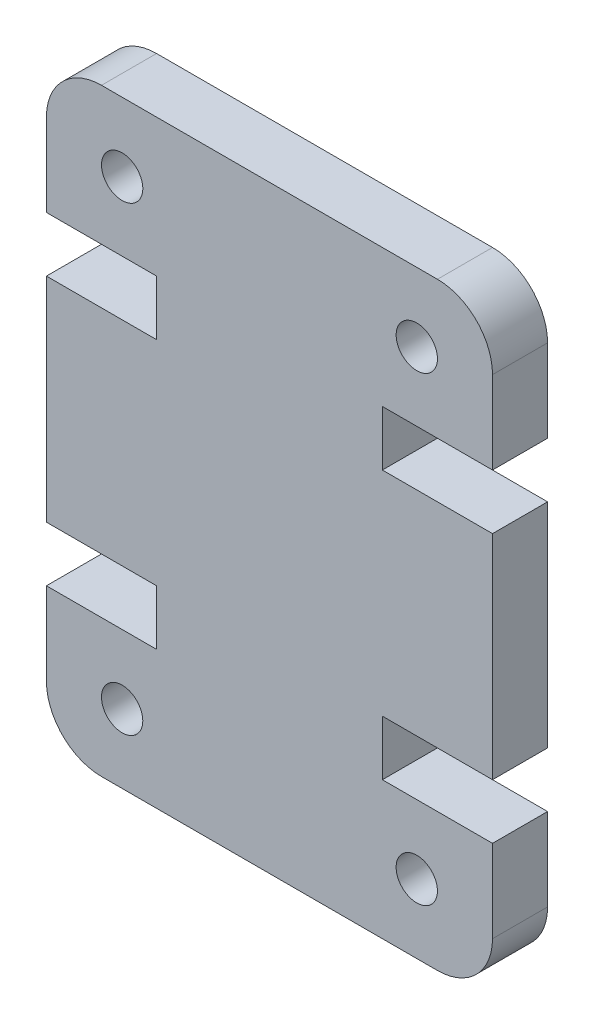
ISO-10303-21;
HEADER;
FILE_DESCRIPTION(('STEP AP214'),'2;1');
FILE_NAME('part.step','',(''),(''),'','','');
FILE_SCHEMA(('AUTOMOTIVE_DESIGN { 1 0 10303 214 1 1 1 1 }'));
ENDSEC;
DATA;
#1=APPLICATION_CONTEXT('core data for automotive mechanical design processes');
#2=APPLICATION_PROTOCOL_DEFINITION('international standard','automotive_design',2000,#1);
#3=PRODUCT_CONTEXT('',#1,'mechanical');
#4=PRODUCT('Part','Part','',(#3));
#5=PRODUCT_RELATED_PRODUCT_CATEGORY('part','',(#4));
#6=PRODUCT_DEFINITION_FORMATION('','',#4);
#7=PRODUCT_DEFINITION_CONTEXT('part definition',#1,'design');
#8=PRODUCT_DEFINITION('design','',#6,#7);
#9=PRODUCT_DEFINITION_SHAPE('','',#8);
#10=(LENGTH_UNIT() NAMED_UNIT(*) SI_UNIT(.MILLI.,.METRE.));
#11=(NAMED_UNIT(*) PLANE_ANGLE_UNIT() SI_UNIT($,.RADIAN.));
#12=(NAMED_UNIT(*) SI_UNIT($,.STERADIAN.) SOLID_ANGLE_UNIT());
#13=UNCERTAINTY_MEASURE_WITH_UNIT(LENGTH_MEASURE(1.E-05),#10,'distance_accuracy_value','');
#14=(GEOMETRIC_REPRESENTATION_CONTEXT(3) GLOBAL_UNCERTAINTY_ASSIGNED_CONTEXT((#13)) GLOBAL_UNIT_ASSIGNED_CONTEXT((#10,
#11,#12)) REPRESENTATION_CONTEXT('',''));
#15=CARTESIAN_POINT('',(0.,0.,0.));
#16=DIRECTION('',(0.,0.,1.));
#17=DIRECTION('',(1.,0.,0.));
#18=AXIS2_PLACEMENT_3D('',#15,#16,#17);
#19=CARTESIAN_POINT('',(14.2,2.,2.));
#20=DIRECTION('',(0.,0.,-1.));
#21=DIRECTION('',(-1.,0.,0.));
#22=AXIS2_PLACEMENT_3D('',#19,#20,#21);
#23=PLANE('',#22);
#24=CARTESIAN_POINT('',(2.75000000000004,19.2399999999998,2.));
#25=DIRECTION('',(0.,0.,1.));
#26=DIRECTION('',(-1.,0.,0.));
#27=AXIS2_PLACEMENT_3D('',#24,#25,#26);
#28=CIRCLE('',#27,0.75);
#29=CARTESIAN_POINT('',(2.00000000000004,19.2399999999998,2.));
#30=VERTEX_POINT('',#29);
#31=EDGE_CURVE('E448',#30,#30,#28,.T.);
#32=ORIENTED_EDGE('',*,*,#31,.F.);
#33=EDGE_LOOP('',(#32));
#34=FACE_BOUND('',#33,.T.);
#35=CARTESIAN_POINT('',(13.45,2.50000000000017,2.));
#36=DIRECTION('',(0.,0.,1.));
#37=DIRECTION('',(-1.,0.,0.));
#38=AXIS2_PLACEMENT_3D('',#35,#36,#37);
#39=CIRCLE('',#38,0.750000000000008);
#40=CARTESIAN_POINT('',(12.6999999999999,2.50000000000017,2.));
#41=VERTEX_POINT('',#40);
#42=EDGE_CURVE('E230',#41,#41,#39,.T.);
#43=ORIENTED_EDGE('',*,*,#42,.F.);
#44=EDGE_LOOP('',(#43));
#45=FACE_BOUND('',#44,.T.);
#46=CARTESIAN_POINT('',(14.2,2.,2.));
#47=DIRECTION('',(0.,0.,1.));
#48=DIRECTION('',(-1.,0.,0.));
#49=AXIS2_PLACEMENT_3D('',#46,#47,#48);
#50=CIRCLE('',#49,2.);
#51=CARTESIAN_POINT('',(14.2,0.,2.));
#52=VERTEX_POINT('',#51);
#53=CARTESIAN_POINT('',(16.2,2.,2.));
#54=VERTEX_POINT('',#53);
#55=EDGE_CURVE('E273',#52,#54,#50,.T.);
#56=ORIENTED_EDGE('',*,*,#55,.T.);
#57=DIRECTION('',(0.,1.,0.));
#58=VECTOR('',#57,1.);
#59=CARTESIAN_POINT('',(16.2,2.,2.));
#60=LINE('',#59,#58);
#61=CARTESIAN_POINT('',(16.2,4.99999999999945,2.));
#62=VERTEX_POINT('',#61);
#63=EDGE_CURVE('E141',#54,#62,#60,.T.);
#64=ORIENTED_EDGE('',*,*,#63,.T.);
#65=DIRECTION('',(-1.,0.,0.));
#66=VECTOR('',#65,1.);
#67=CARTESIAN_POINT('',(12.2,4.99999999999945,2.));
#68=LINE('',#67,#66);
#69=CARTESIAN_POINT('',(12.2,4.99999999999945,2.));
#70=VERTEX_POINT('',#69);
#71=EDGE_CURVE('E336',#62,#70,#68,.T.);
#72=ORIENTED_EDGE('',*,*,#71,.T.);
#73=DIRECTION('',(0.,1.,0.));
#74=VECTOR('',#73,1.);
#75=CARTESIAN_POINT('',(12.2,6.99999999999945,2.));
#76=LINE('',#75,#74);
#77=CARTESIAN_POINT('',(12.2,6.99999999999945,2.));
#78=VERTEX_POINT('',#77);
#79=EDGE_CURVE('E355',#70,#78,#76,.T.);
#80=ORIENTED_EDGE('',*,*,#79,.T.);
#81=DIRECTION('',(1.,0.,0.));
#82=VECTOR('',#81,1.);
#83=CARTESIAN_POINT('',(16.2,6.99999999999945,2.));
#84=LINE('',#83,#82);
#85=CARTESIAN_POINT('',(16.2,6.99999999999945,2.));
#86=VERTEX_POINT('',#85);
#87=EDGE_CURVE('E352',#78,#86,#84,.T.);
#88=ORIENTED_EDGE('',*,*,#87,.T.);
#89=DIRECTION('',(0.,1.,0.));
#90=VECTOR('',#89,1.);
#91=CARTESIAN_POINT('',(16.2,14.7400000000005,2.));
#92=LINE('',#91,#90);
#93=CARTESIAN_POINT('',(16.2,14.7400000000005,2.));
#94=VERTEX_POINT('',#93);
#95=EDGE_CURVE('E354',#86,#94,#92,.T.);
#96=ORIENTED_EDGE('',*,*,#95,.T.);
#97=DIRECTION('',(-1.,0.,0.));
#98=VECTOR('',#97,1.);
#99=CARTESIAN_POINT('',(16.2,14.7400000000005,2.));
#100=LINE('',#99,#98);
#101=CARTESIAN_POINT('',(12.2,14.7400000000005,2.));
#102=VERTEX_POINT('',#101);
#103=EDGE_CURVE('E357',#94,#102,#100,.T.);
#104=ORIENTED_EDGE('',*,*,#103,.T.);
#105=DIRECTION('',(0.,1.,0.));
#106=VECTOR('',#105,1.);
#107=CARTESIAN_POINT('',(12.2,14.7400000000005,2.));
#108=LINE('',#107,#106);
#109=CARTESIAN_POINT('',(12.2,16.7400000000005,2.));
#110=VERTEX_POINT('',#109);
#111=EDGE_CURVE('E363',#102,#110,#108,.T.);
#112=ORIENTED_EDGE('',*,*,#111,.T.);
#113=DIRECTION('',(1.,0.,0.));
#114=VECTOR('',#113,1.);
#115=CARTESIAN_POINT('',(12.2,16.7400000000005,2.));
#116=LINE('',#115,#114);
#117=CARTESIAN_POINT('',(16.2,16.7400000000005,2.));
#118=VERTEX_POINT('',#117);
#119=EDGE_CURVE('E365',#110,#118,#116,.T.);
#120=ORIENTED_EDGE('',*,*,#119,.T.);
#121=DIRECTION('',(0.,1.,0.));
#122=VECTOR('',#121,1.);
#123=CARTESIAN_POINT('',(16.2,19.74,2.));
#124=LINE('',#123,#122);
#125=CARTESIAN_POINT('',(16.2,19.74,2.));
#126=VERTEX_POINT('',#125);
#127=EDGE_CURVE('E367',#118,#126,#124,.T.);
#128=ORIENTED_EDGE('',*,*,#127,.T.);
#129=CARTESIAN_POINT('',(14.2,19.74,2.));
#130=DIRECTION('',(0.,0.,1.));
#131=DIRECTION('',(1.,0.,0.));
#132=AXIS2_PLACEMENT_3D('',#129,#130,#131);
#133=CIRCLE('',#132,2.);
#134=CARTESIAN_POINT('',(14.2,21.74,2.));
#135=VERTEX_POINT('',#134);
#136=EDGE_CURVE('E369',#126,#135,#133,.T.);
#137=ORIENTED_EDGE('',*,*,#136,.T.);
#138=DIRECTION('',(-1.,0.,0.));
#139=VECTOR('',#138,1.);
#140=CARTESIAN_POINT('',(1.99999999999999,21.74,2.));
#141=LINE('',#140,#139);
#142=CARTESIAN_POINT('',(1.99999999999999,21.74,2.));
#143=VERTEX_POINT('',#142);
#144=EDGE_CURVE('E371',#135,#143,#141,.T.);
#145=ORIENTED_EDGE('',*,*,#144,.T.);
#146=CARTESIAN_POINT('',(2.,19.74,2.));
#147=DIRECTION('',(0.,0.,1.));
#148=DIRECTION('',(-1.,0.,0.));
#149=AXIS2_PLACEMENT_3D('',#146,#147,#148);
#150=CIRCLE('',#149,2.);
#151=CARTESIAN_POINT('',(0.,19.74,2.));
#152=VERTEX_POINT('',#151);
#153=EDGE_CURVE('E373',#143,#152,#150,.T.);
#154=ORIENTED_EDGE('',*,*,#153,.T.);
#155=DIRECTION('',(0.,-1.,0.));
#156=VECTOR('',#155,1.);
#157=CARTESIAN_POINT('',(0.,19.74,2.));
#158=LINE('',#157,#156);
#159=CARTESIAN_POINT('',(0.,16.7400000000005,2.));
#160=VERTEX_POINT('',#159);
#161=EDGE_CURVE('E375',#152,#160,#158,.T.);
#162=ORIENTED_EDGE('',*,*,#161,.T.);
#163=DIRECTION('',(1.,0.,0.));
#164=VECTOR('',#163,1.);
#165=CARTESIAN_POINT('',(4.,16.7400000000005,2.));
#166=LINE('',#165,#164);
#167=CARTESIAN_POINT('',(4.,16.7400000000005,2.));
#168=VERTEX_POINT('',#167);
#169=EDGE_CURVE('E377',#160,#168,#166,.T.);
#170=ORIENTED_EDGE('',*,*,#169,.T.);
#171=DIRECTION('',(0.,-1.,0.));
#172=VECTOR('',#171,1.);
#173=CARTESIAN_POINT('',(4.,14.7400000000005,2.));
#174=LINE('',#173,#172);
#175=CARTESIAN_POINT('',(4.,14.7400000000005,2.));
#176=VERTEX_POINT('',#175);
#177=EDGE_CURVE('E379',#168,#176,#174,.T.);
#178=ORIENTED_EDGE('',*,*,#177,.T.);
#179=DIRECTION('',(-1.,0.,0.));
#180=VECTOR('',#179,1.);
#181=CARTESIAN_POINT('',(0.,14.7400000000005,2.));
#182=LINE('',#181,#180);
#183=CARTESIAN_POINT('',(0.,14.7400000000005,2.));
#184=VERTEX_POINT('',#183);
#185=EDGE_CURVE('E381',#176,#184,#182,.T.);
#186=ORIENTED_EDGE('',*,*,#185,.T.);
#187=DIRECTION('',(0.,-1.,0.));
#188=VECTOR('',#187,1.);
#189=CARTESIAN_POINT('',(0.,14.7400000000005,2.));
#190=LINE('',#189,#188);
#191=CARTESIAN_POINT('',(0.,6.99999999999946,2.));
#192=VERTEX_POINT('',#191);
#193=EDGE_CURVE('E383',#184,#192,#190,.T.);
#194=ORIENTED_EDGE('',*,*,#193,.T.);
#195=DIRECTION('',(1.,0.,0.));
#196=VECTOR('',#195,1.);
#197=CARTESIAN_POINT('',(0.,6.99999999999946,2.));
#198=LINE('',#197,#196);
#199=CARTESIAN_POINT('',(4.00000000000002,6.99999999999946,2.));
#200=VERTEX_POINT('',#199);
#201=EDGE_CURVE('E385',#192,#200,#198,.T.);
#202=ORIENTED_EDGE('',*,*,#201,.T.);
#203=DIRECTION('',(0.,-1.,0.));
#204=VECTOR('',#203,1.);
#205=CARTESIAN_POINT('',(4.00000000000002,6.99999999999946,2.));
#206=LINE('',#205,#204);
#207=CARTESIAN_POINT('',(4.,4.99999999999945,2.));
#208=VERTEX_POINT('',#207);
#209=EDGE_CURVE('E387',#200,#208,#206,.T.);
#210=ORIENTED_EDGE('',*,*,#209,.T.);
#211=DIRECTION('',(-1.,0.,0.));
#212=VECTOR('',#211,1.);
#213=CARTESIAN_POINT('',(4.,4.99999999999945,2.));
#214=LINE('',#213,#212);
#215=CARTESIAN_POINT('',(0.,4.99999999999945,2.));
#216=VERTEX_POINT('',#215);
#217=EDGE_CURVE('E208',#208,#216,#214,.T.);
#218=ORIENTED_EDGE('',*,*,#217,.T.);
#219=DIRECTION('',(0.,-1.,0.));
#220=VECTOR('',#219,1.);
#221=CARTESIAN_POINT('',(0.,2.,2.));
#222=LINE('',#221,#220);
#223=CARTESIAN_POINT('',(0.,2.,2.));
#224=VERTEX_POINT('',#223);
#225=EDGE_CURVE('E202',#216,#224,#222,.T.);
#226=ORIENTED_EDGE('',*,*,#225,.T.);
#227=CARTESIAN_POINT('',(2.00000000000002,2.,2.));
#228=DIRECTION('',(0.,0.,1.));
#229=DIRECTION('',(1.,0.,0.));
#230=AXIS2_PLACEMENT_3D('',#227,#228,#229);
#231=CIRCLE('',#230,2.00000000000001);
#232=CARTESIAN_POINT('',(2.00000000000002,0.,2.));
#233=VERTEX_POINT('',#232);
#234=EDGE_CURVE('E206',#224,#233,#231,.T.);
#235=ORIENTED_EDGE('',*,*,#234,.T.);
#236=DIRECTION('',(1.,0.,0.));
#237=VECTOR('',#236,1.);
#238=CARTESIAN_POINT('',(2.00000000000002,0.,2.));
#239=LINE('',#238,#237);
#240=EDGE_CURVE('E50',#233,#52,#239,.T.);
#241=ORIENTED_EDGE('',*,*,#240,.T.);
#242=EDGE_LOOP('',(#56,#64,#72,#80,#88,#96,#104,#112,#120,#128,#137,#145,#154,#162,#170,#178,
#186,#194,#202,#210,#218,#226,#235,#241));
#243=FACE_BOUND('',#242,.T.);
#244=CARTESIAN_POINT('',(2.75000000000004,2.50000000000017,2.));
#245=DIRECTION('',(0.,0.,1.));
#246=DIRECTION('',(1.,0.,0.));
#247=AXIS2_PLACEMENT_3D('',#244,#245,#246);
#248=CIRCLE('',#247,0.75);
#249=CARTESIAN_POINT('',(3.50000000000004,2.50000000000017,2.));
#250=VERTEX_POINT('',#249);
#251=EDGE_CURVE('E454',#250,#250,#248,.T.);
#252=ORIENTED_EDGE('',*,*,#251,.F.);
#253=EDGE_LOOP('',(#252));
#254=FACE_BOUND('',#253,.T.);
#255=CARTESIAN_POINT('',(13.45,19.2399999999998,2.));
#256=DIRECTION('',(0.,0.,1.));
#257=DIRECTION('',(1.,0.,0.));
#258=AXIS2_PLACEMENT_3D('',#255,#256,#257);
#259=CIRCLE('',#258,0.750000000000007);
#260=CARTESIAN_POINT('',(14.2,19.2399999999998,2.));
#261=VERTEX_POINT('',#260);
#262=EDGE_CURVE('E439',#261,#261,#259,.T.);
#263=ORIENTED_EDGE('',*,*,#262,.F.);
#264=EDGE_LOOP('',(#263));
#265=FACE_BOUND('',#264,.T.);
#266=ADVANCED_FACE('F33',(#34,#45,#243,#254,#265),#23,.F.);
#267=CARTESIAN_POINT('',(14.2,2.,0.));
#268=DIRECTION('',(0.,0.,-1.));
#269=DIRECTION('',(-1.,0.,0.));
#270=AXIS2_PLACEMENT_3D('',#267,#268,#269);
#271=PLANE('',#270);
#272=CARTESIAN_POINT('',(2.75000000000004,19.2399999999998,0.));
#273=DIRECTION('',(0.,0.,1.));
#274=DIRECTION('',(-1.,0.,0.));
#275=AXIS2_PLACEMENT_3D('',#272,#273,#274);
#276=CIRCLE('',#275,0.75);
#277=CARTESIAN_POINT('',(2.00000000000004,19.2399999999998,0.));
#278=VERTEX_POINT('',#277);
#279=EDGE_CURVE('E445',#278,#278,#276,.T.);
#280=ORIENTED_EDGE('',*,*,#279,.T.);
#281=EDGE_LOOP('',(#280));
#282=FACE_BOUND('',#281,.T.);
#283=CARTESIAN_POINT('',(13.45,2.50000000000017,0.));
#284=DIRECTION('',(0.,0.,1.));
#285=DIRECTION('',(-1.,0.,0.));
#286=AXIS2_PLACEMENT_3D('',#283,#284,#285);
#287=CIRCLE('',#286,0.750000000000008);
#288=CARTESIAN_POINT('',(12.6999999999999,2.50000000000017,0.));
#289=VERTEX_POINT('',#288);
#290=EDGE_CURVE('E457',#289,#289,#287,.T.);
#291=ORIENTED_EDGE('',*,*,#290,.T.);
#292=EDGE_LOOP('',(#291));
#293=FACE_BOUND('',#292,.T.);
#294=CARTESIAN_POINT('',(14.2,2.,0.));
#295=DIRECTION('',(0.,0.,1.));
#296=DIRECTION('',(-1.,0.,0.));
#297=AXIS2_PLACEMENT_3D('',#294,#295,#296);
#298=CIRCLE('',#297,2.);
#299=CARTESIAN_POINT('',(14.2,0.,0.));
#300=VERTEX_POINT('',#299);
#301=CARTESIAN_POINT('',(16.2,2.,0.));
#302=VERTEX_POINT('',#301);
#303=EDGE_CURVE('E226',#300,#302,#298,.T.);
#304=ORIENTED_EDGE('',*,*,#303,.F.);
#305=DIRECTION('',(1.,0.,0.));
#306=VECTOR('',#305,1.);
#307=CARTESIAN_POINT('',(2.00000000000002,0.,0.));
#308=LINE('',#307,#306);
#309=CARTESIAN_POINT('',(2.00000000000002,0.,0.));
#310=VERTEX_POINT('',#309);
#311=EDGE_CURVE('E133',#310,#300,#308,.T.);
#312=ORIENTED_EDGE('',*,*,#311,.F.);
#313=CARTESIAN_POINT('',(2.00000000000002,2.,0.));
#314=DIRECTION('',(0.,0.,1.));
#315=DIRECTION('',(1.,0.,0.));
#316=AXIS2_PLACEMENT_3D('',#313,#314,#315);
#317=CIRCLE('',#316,2.00000000000001);
#318=CARTESIAN_POINT('',(0.,2.,0.));
#319=VERTEX_POINT('',#318);
#320=EDGE_CURVE('E127',#319,#310,#317,.T.);
#321=ORIENTED_EDGE('',*,*,#320,.F.);
#322=DIRECTION('',(0.,-1.,0.));
#323=VECTOR('',#322,1.);
#324=CARTESIAN_POINT('',(0.,2.,0.));
#325=LINE('',#324,#323);
#326=CARTESIAN_POINT('',(0.,4.99999999999945,0.));
#327=VERTEX_POINT('',#326);
#328=EDGE_CURVE('E216',#327,#319,#325,.T.);
#329=ORIENTED_EDGE('',*,*,#328,.F.);
#330=DIRECTION('',(-1.,0.,0.));
#331=VECTOR('',#330,1.);
#332=CARTESIAN_POINT('',(4.,4.99999999999945,0.));
#333=LINE('',#332,#331);
#334=CARTESIAN_POINT('',(4.,4.99999999999945,0.));
#335=VERTEX_POINT('',#334);
#336=EDGE_CURVE('E268',#335,#327,#333,.T.);
#337=ORIENTED_EDGE('',*,*,#336,.F.);
#338=DIRECTION('',(0.,-1.,0.));
#339=VECTOR('',#338,1.);
#340=CARTESIAN_POINT('',(4.00000000000002,6.99999999999946,0.));
#341=LINE('',#340,#339);
#342=CARTESIAN_POINT('',(4.00000000000002,6.99999999999946,0.));
#343=VERTEX_POINT('',#342);
#344=EDGE_CURVE('E266',#343,#335,#341,.T.);
#345=ORIENTED_EDGE('',*,*,#344,.F.);
#346=DIRECTION('',(1.,0.,0.));
#347=VECTOR('',#346,1.);
#348=CARTESIAN_POINT('',(0.,6.99999999999946,0.));
#349=LINE('',#348,#347);
#350=CARTESIAN_POINT('',(0.,6.99999999999946,0.));
#351=VERTEX_POINT('',#350);
#352=EDGE_CURVE('E264',#351,#343,#349,.T.);
#353=ORIENTED_EDGE('',*,*,#352,.F.);
#354=DIRECTION('',(0.,-1.,0.));
#355=VECTOR('',#354,1.);
#356=CARTESIAN_POINT('',(0.,14.7400000000005,0.));
#357=LINE('',#356,#355);
#358=CARTESIAN_POINT('',(0.,14.7400000000005,0.));
#359=VERTEX_POINT('',#358);
#360=EDGE_CURVE('E262',#359,#351,#357,.T.);
#361=ORIENTED_EDGE('',*,*,#360,.F.);
#362=DIRECTION('',(-1.,0.,0.));
#363=VECTOR('',#362,1.);
#364=CARTESIAN_POINT('',(0.,14.7400000000005,0.));
#365=LINE('',#364,#363);
#366=CARTESIAN_POINT('',(4.,14.7400000000005,0.));
#367=VERTEX_POINT('',#366);
#368=EDGE_CURVE('E260',#367,#359,#365,.T.);
#369=ORIENTED_EDGE('',*,*,#368,.F.);
#370=DIRECTION('',(0.,-1.,0.));
#371=VECTOR('',#370,1.);
#372=CARTESIAN_POINT('',(4.,14.7400000000005,0.));
#373=LINE('',#372,#371);
#374=CARTESIAN_POINT('',(4.,16.7400000000005,0.));
#375=VERTEX_POINT('',#374);
#376=EDGE_CURVE('E258',#375,#367,#373,.T.);
#377=ORIENTED_EDGE('',*,*,#376,.F.);
#378=DIRECTION('',(1.,0.,0.));
#379=VECTOR('',#378,1.);
#380=CARTESIAN_POINT('',(4.,16.7400000000005,0.));
#381=LINE('',#380,#379);
#382=CARTESIAN_POINT('',(0.,16.7400000000005,0.));
#383=VERTEX_POINT('',#382);
#384=EDGE_CURVE('E256',#383,#375,#381,.T.);
#385=ORIENTED_EDGE('',*,*,#384,.F.);
#386=DIRECTION('',(0.,-1.,0.));
#387=VECTOR('',#386,1.);
#388=CARTESIAN_POINT('',(0.,19.74,0.));
#389=LINE('',#388,#387);
#390=CARTESIAN_POINT('',(0.,19.74,0.));
#391=VERTEX_POINT('',#390);
#392=EDGE_CURVE('E254',#391,#383,#389,.T.);
#393=ORIENTED_EDGE('',*,*,#392,.F.);
#394=CARTESIAN_POINT('',(2.,19.74,0.));
#395=DIRECTION('',(0.,0.,1.));
#396=DIRECTION('',(-1.,0.,0.));
#397=AXIS2_PLACEMENT_3D('',#394,#395,#396);
#398=CIRCLE('',#397,2.);
#399=CARTESIAN_POINT('',(1.99999999999999,21.74,0.));
#400=VERTEX_POINT('',#399);
#401=EDGE_CURVE('E252',#400,#391,#398,.T.);
#402=ORIENTED_EDGE('',*,*,#401,.F.);
#403=DIRECTION('',(-1.,0.,0.));
#404=VECTOR('',#403,1.);
#405=CARTESIAN_POINT('',(1.99999999999999,21.74,0.));
#406=LINE('',#405,#404);
#407=CARTESIAN_POINT('',(14.2,21.74,0.));
#408=VERTEX_POINT('',#407);
#409=EDGE_CURVE('E250',#408,#400,#406,.T.);
#410=ORIENTED_EDGE('',*,*,#409,.F.);
#411=CARTESIAN_POINT('',(14.2,19.74,0.));
#412=DIRECTION('',(0.,0.,1.));
#413=DIRECTION('',(1.,0.,0.));
#414=AXIS2_PLACEMENT_3D('',#411,#412,#413);
#415=CIRCLE('',#414,2.);
#416=CARTESIAN_POINT('',(16.2,19.74,0.));
#417=VERTEX_POINT('',#416);
#418=EDGE_CURVE('E248',#417,#408,#415,.T.);
#419=ORIENTED_EDGE('',*,*,#418,.F.);
#420=DIRECTION('',(0.,1.,0.));
#421=VECTOR('',#420,1.);
#422=CARTESIAN_POINT('',(16.2,19.74,0.));
#423=LINE('',#422,#421);
#424=CARTESIAN_POINT('',(16.2,16.7400000000005,0.));
#425=VERTEX_POINT('',#424);
#426=EDGE_CURVE('E246',#425,#417,#423,.T.);
#427=ORIENTED_EDGE('',*,*,#426,.F.);
#428=DIRECTION('',(1.,0.,0.));
#429=VECTOR('',#428,1.);
#430=CARTESIAN_POINT('',(12.2,16.7400000000005,0.));
#431=LINE('',#430,#429);
#432=CARTESIAN_POINT('',(12.2,16.7400000000005,0.));
#433=VERTEX_POINT('',#432);
#434=EDGE_CURVE('E244',#433,#425,#431,.T.);
#435=ORIENTED_EDGE('',*,*,#434,.F.);
#436=DIRECTION('',(0.,1.,0.));
#437=VECTOR('',#436,1.);
#438=CARTESIAN_POINT('',(12.2,14.7400000000005,0.));
#439=LINE('',#438,#437);
#440=CARTESIAN_POINT('',(12.2,14.7400000000005,0.));
#441=VERTEX_POINT('',#440);
#442=EDGE_CURVE('E242',#441,#433,#439,.T.);
#443=ORIENTED_EDGE('',*,*,#442,.F.);
#444=DIRECTION('',(-1.,0.,0.));
#445=VECTOR('',#444,1.);
#446=CARTESIAN_POINT('',(16.2,14.7400000000005,0.));
#447=LINE('',#446,#445);
#448=CARTESIAN_POINT('',(16.2,14.7400000000005,0.));
#449=VERTEX_POINT('',#448);
#450=EDGE_CURVE('E240',#449,#441,#447,.T.);
#451=ORIENTED_EDGE('',*,*,#450,.F.);
#452=DIRECTION('',(0.,1.,0.));
#453=VECTOR('',#452,1.);
#454=CARTESIAN_POINT('',(16.2,14.7400000000005,0.));
#455=LINE('',#454,#453);
#456=CARTESIAN_POINT('',(16.2,6.99999999999945,0.));
#457=VERTEX_POINT('',#456);
#458=EDGE_CURVE('E238',#457,#449,#455,.T.);
#459=ORIENTED_EDGE('',*,*,#458,.F.);
#460=DIRECTION('',(1.,0.,0.));
#461=VECTOR('',#460,1.);
#462=CARTESIAN_POINT('',(16.2,6.99999999999945,0.));
#463=LINE('',#462,#461);
#464=CARTESIAN_POINT('',(12.2,6.99999999999945,0.));
#465=VERTEX_POINT('',#464);
#466=EDGE_CURVE('E236',#465,#457,#463,.T.);
#467=ORIENTED_EDGE('',*,*,#466,.F.);
#468=DIRECTION('',(0.,1.,0.));
#469=VECTOR('',#468,1.);
#470=CARTESIAN_POINT('',(12.2,6.99999999999945,0.));
#471=LINE('',#470,#469);
#472=CARTESIAN_POINT('',(12.2,4.99999999999945,0.));
#473=VERTEX_POINT('',#472);
#474=EDGE_CURVE('E234',#473,#465,#471,.T.);
#475=ORIENTED_EDGE('',*,*,#474,.F.);
#476=DIRECTION('',(-1.,0.,0.));
#477=VECTOR('',#476,1.);
#478=CARTESIAN_POINT('',(12.2,4.99999999999945,0.));
#479=LINE('',#478,#477);
#480=CARTESIAN_POINT('',(16.2,4.99999999999945,0.));
#481=VERTEX_POINT('',#480);
#482=EDGE_CURVE('E232',#481,#473,#479,.T.);
#483=ORIENTED_EDGE('',*,*,#482,.F.);
#484=DIRECTION('',(0.,1.,0.));
#485=VECTOR('',#484,1.);
#486=CARTESIAN_POINT('',(16.2,2.,0.));
#487=LINE('',#486,#485);
#488=EDGE_CURVE('E229',#302,#481,#487,.T.);
#489=ORIENTED_EDGE('',*,*,#488,.F.);
#490=EDGE_LOOP('',(#304,#312,#321,#329,#337,#345,#353,#361,#369,#377,#385,#393,#402,#410,#419,
#427,#435,#443,#451,#459,#467,#475,#483,#489));
#491=FACE_BOUND('',#490,.T.);
#492=CARTESIAN_POINT('',(2.75000000000004,2.50000000000017,0.));
#493=DIRECTION('',(0.,0.,1.));
#494=DIRECTION('',(1.,0.,0.));
#495=AXIS2_PLACEMENT_3D('',#492,#493,#494);
#496=CIRCLE('',#495,0.75);
#497=CARTESIAN_POINT('',(3.50000000000004,2.50000000000017,0.));
#498=VERTEX_POINT('',#497);
#499=EDGE_CURVE('E451',#498,#498,#496,.T.);
#500=ORIENTED_EDGE('',*,*,#499,.T.);
#501=EDGE_LOOP('',(#500));
#502=FACE_BOUND('',#501,.T.);
#503=CARTESIAN_POINT('',(13.45,19.2399999999998,0.));
#504=DIRECTION('',(0.,0.,1.));
#505=DIRECTION('',(1.,0.,0.));
#506=AXIS2_PLACEMENT_3D('',#503,#504,#505);
#507=CIRCLE('',#506,0.750000000000007);
#508=CARTESIAN_POINT('',(14.2,19.2399999999998,0.));
#509=VERTEX_POINT('',#508);
#510=EDGE_CURVE('E442',#509,#509,#507,.T.);
#511=ORIENTED_EDGE('',*,*,#510,.T.);
#512=EDGE_LOOP('',(#511));
#513=FACE_BOUND('',#512,.T.);
#514=ADVANCED_FACE('F340',(#282,#293,#491,#502,#513),#271,.T.);
#515=CARTESIAN_POINT('',(14.2,2.,2.));
#516=DIRECTION('',(0.,0.,-1.));
#517=DIRECTION('',(-1.,0.,0.));
#518=AXIS2_PLACEMENT_3D('',#515,#516,#517);
#519=CYLINDRICAL_SURFACE('',#518,2.);
#520=ORIENTED_EDGE('',*,*,#303,.T.);
#521=DIRECTION('',(0.,0.,-1.));
#522=VECTOR('',#521,1.);
#523=CARTESIAN_POINT('',(16.2,2.,2.));
#524=LINE('',#523,#522);
#525=EDGE_CURVE('E11',#54,#302,#524,.T.);
#526=ORIENTED_EDGE('',*,*,#525,.F.);
#527=ORIENTED_EDGE('',*,*,#55,.F.);
#528=DIRECTION('',(0.,0.,-1.));
#529=VECTOR('',#528,1.);
#530=CARTESIAN_POINT('',(14.2,0.,2.));
#531=LINE('',#530,#529);
#532=EDGE_CURVE('E222',#52,#300,#531,.T.);
#533=ORIENTED_EDGE('',*,*,#532,.T.);
#534=EDGE_LOOP('',(#520,#526,#527,#533));
#535=FACE_BOUND('',#534,.T.);
#536=ADVANCED_FACE('F35',(#535),#519,.T.);
#537=CARTESIAN_POINT('',(16.2,2.,2.));
#538=DIRECTION('',(-1.,0.,0.));
#539=DIRECTION('',(0.,-1.,0.));
#540=AXIS2_PLACEMENT_3D('',#537,#538,#539);
#541=PLANE('',#540);
#542=ORIENTED_EDGE('',*,*,#488,.T.);
#543=DIRECTION('',(0.,0.,-1.));
#544=VECTOR('',#543,1.);
#545=CARTESIAN_POINT('',(16.2,4.99999999999945,2.));
#546=LINE('',#545,#544);
#547=EDGE_CURVE('E42',#62,#481,#546,.T.);
#548=ORIENTED_EDGE('',*,*,#547,.F.);
#549=ORIENTED_EDGE('',*,*,#63,.F.);
#550=ORIENTED_EDGE('',*,*,#525,.T.);
#551=EDGE_LOOP('',(#542,#548,#549,#550));
#552=FACE_BOUND('',#551,.T.);
#553=ADVANCED_FACE('F686',(#552),#541,.F.);
#554=CARTESIAN_POINT('',(12.2,4.99999999999945,2.));
#555=DIRECTION('',(0.,-1.,0.));
#556=DIRECTION('',(0.,0.,-1.));
#557=AXIS2_PLACEMENT_3D('',#554,#555,#556);
#558=PLANE('',#557);
#559=ORIENTED_EDGE('',*,*,#482,.T.);
#560=DIRECTION('',(0.,0.,-1.));
#561=VECTOR('',#560,1.);
#562=CARTESIAN_POINT('',(12.2,4.99999999999945,2.));
#563=LINE('',#562,#561);
#564=EDGE_CURVE('E328',#70,#473,#563,.T.);
#565=ORIENTED_EDGE('',*,*,#564,.F.);
#566=ORIENTED_EDGE('',*,*,#71,.F.);
#567=ORIENTED_EDGE('',*,*,#547,.T.);
#568=EDGE_LOOP('',(#559,#565,#566,#567));
#569=FACE_BOUND('',#568,.T.);
#570=ADVANCED_FACE('F334',(#569),#558,.F.);
#571=CARTESIAN_POINT('',(12.2,6.99999999999945,2.));
#572=DIRECTION('',(-1.,0.,0.));
#573=DIRECTION('',(0.,0.,1.));
#574=AXIS2_PLACEMENT_3D('',#571,#572,#573);
#575=PLANE('',#574);
#576=ORIENTED_EDGE('',*,*,#474,.T.);
#577=DIRECTION('',(0.,0.,-1.));
#578=VECTOR('',#577,1.);
#579=CARTESIAN_POINT('',(12.2,6.99999999999945,2.));
#580=LINE('',#579,#578);
#581=EDGE_CURVE('E325',#78,#465,#580,.T.);
#582=ORIENTED_EDGE('',*,*,#581,.F.);
#583=ORIENTED_EDGE('',*,*,#79,.F.);
#584=ORIENTED_EDGE('',*,*,#564,.T.);
#585=EDGE_LOOP('',(#576,#582,#583,#584));
#586=FACE_BOUND('',#585,.T.);
#587=ADVANCED_FACE('F346',(#586),#575,.F.);
#588=CARTESIAN_POINT('',(16.2,6.99999999999945,2.));
#589=DIRECTION('',(0.,1.,0.));
#590=DIRECTION('',(-1.,0.,0.));
#591=AXIS2_PLACEMENT_3D('',#588,#589,#590);
#592=PLANE('',#591);
#593=ORIENTED_EDGE('',*,*,#466,.T.);
#594=DIRECTION('',(0.,0.,-1.));
#595=VECTOR('',#594,1.);
#596=CARTESIAN_POINT('',(16.2,6.99999999999945,2.));
#597=LINE('',#596,#595);
#598=EDGE_CURVE('E322',#86,#457,#597,.T.);
#599=ORIENTED_EDGE('',*,*,#598,.F.);
#600=ORIENTED_EDGE('',*,*,#87,.F.);
#601=ORIENTED_EDGE('',*,*,#581,.T.);
#602=EDGE_LOOP('',(#593,#599,#600,#601));
#603=FACE_BOUND('',#602,.T.);
#604=ADVANCED_FACE('F350',(#603),#592,.F.);
#605=CARTESIAN_POINT('',(16.2,14.7400000000005,2.));
#606=DIRECTION('',(-1.,0.,0.));
#607=DIRECTION('',(0.,0.,1.));
#608=AXIS2_PLACEMENT_3D('',#605,#606,#607);
#609=PLANE('',#608);
#610=ORIENTED_EDGE('',*,*,#458,.T.);
#611=DIRECTION('',(0.,0.,-1.));
#612=VECTOR('',#611,1.);
#613=CARTESIAN_POINT('',(16.2,14.7400000000005,2.));
#614=LINE('',#613,#612);
#615=EDGE_CURVE('E319',#94,#449,#614,.T.);
#616=ORIENTED_EDGE('',*,*,#615,.F.);
#617=ORIENTED_EDGE('',*,*,#95,.F.);
#618=ORIENTED_EDGE('',*,*,#598,.T.);
#619=EDGE_LOOP('',(#610,#616,#617,#618));
#620=FACE_BOUND('',#619,.T.);
#621=ADVANCED_FACE('F651',(#620),#609,.F.);
#622=CARTESIAN_POINT('',(16.2,14.7400000000005,2.));
#623=DIRECTION('',(0.,-1.,0.));
#624=DIRECTION('',(1.,0.,0.));
#625=AXIS2_PLACEMENT_3D('',#622,#623,#624);
#626=PLANE('',#625);
#627=ORIENTED_EDGE('',*,*,#450,.T.);
#628=DIRECTION('',(0.,0.,-1.));
#629=VECTOR('',#628,1.);
#630=CARTESIAN_POINT('',(12.2,14.7400000000005,2.));
#631=LINE('',#630,#629);
#632=EDGE_CURVE('E316',#102,#441,#631,.T.);
#633=ORIENTED_EDGE('',*,*,#632,.F.);
#634=ORIENTED_EDGE('',*,*,#103,.F.);
#635=ORIENTED_EDGE('',*,*,#615,.T.);
#636=EDGE_LOOP('',(#627,#633,#634,#635));
#637=FACE_BOUND('',#636,.T.);
#638=ADVANCED_FACE('F641',(#637),#626,.F.);
#639=CARTESIAN_POINT('',(12.2,14.7400000000005,2.));
#640=DIRECTION('',(-1.,0.,0.));
#641=DIRECTION('',(0.,0.,1.));
#642=AXIS2_PLACEMENT_3D('',#639,#640,#641);
#643=PLANE('',#642);
#644=ORIENTED_EDGE('',*,*,#442,.T.);
#645=DIRECTION('',(0.,0.,-1.));
#646=VECTOR('',#645,1.);
#647=CARTESIAN_POINT('',(12.2,16.7400000000005,2.));
#648=LINE('',#647,#646);
#649=EDGE_CURVE('E313',#110,#433,#648,.T.);
#650=ORIENTED_EDGE('',*,*,#649,.F.);
#651=ORIENTED_EDGE('',*,*,#111,.F.);
#652=ORIENTED_EDGE('',*,*,#632,.T.);
#653=EDGE_LOOP('',(#644,#650,#651,#652));
#654=FACE_BOUND('',#653,.T.);
#655=ADVANCED_FACE('F631',(#654),#643,.F.);
#656=CARTESIAN_POINT('',(12.2,16.7400000000005,2.));
#657=DIRECTION('',(0.,1.,0.));
#658=DIRECTION('',(0.,0.,1.));
#659=AXIS2_PLACEMENT_3D('',#656,#657,#658);
#660=PLANE('',#659);
#661=ORIENTED_EDGE('',*,*,#434,.T.);
#662=DIRECTION('',(0.,0.,-1.));
#663=VECTOR('',#662,1.);
#664=CARTESIAN_POINT('',(16.2,16.7400000000005,2.));
#665=LINE('',#664,#663);
#666=EDGE_CURVE('E310',#118,#425,#665,.T.);
#667=ORIENTED_EDGE('',*,*,#666,.F.);
#668=ORIENTED_EDGE('',*,*,#119,.F.);
#669=ORIENTED_EDGE('',*,*,#649,.T.);
#670=EDGE_LOOP('',(#661,#667,#668,#669));
#671=FACE_BOUND('',#670,.T.);
#672=ADVANCED_FACE('F621',(#671),#660,.F.);
#673=CARTESIAN_POINT('',(16.2,19.74,2.));
#674=DIRECTION('',(-1.,0.,0.));
#675=DIRECTION('',(0.,-1.,0.));
#676=AXIS2_PLACEMENT_3D('',#673,#674,#675);
#677=PLANE('',#676);
#678=ORIENTED_EDGE('',*,*,#426,.T.);
#679=DIRECTION('',(0.,0.,-1.));
#680=VECTOR('',#679,1.);
#681=CARTESIAN_POINT('',(16.2,19.74,2.));
#682=LINE('',#681,#680);
#683=EDGE_CURVE('E307',#126,#417,#682,.T.);
#684=ORIENTED_EDGE('',*,*,#683,.F.);
#685=ORIENTED_EDGE('',*,*,#127,.F.);
#686=ORIENTED_EDGE('',*,*,#666,.T.);
#687=EDGE_LOOP('',(#678,#684,#685,#686));
#688=FACE_BOUND('',#687,.T.);
#689=ADVANCED_FACE('F611',(#688),#677,.F.);
#690=CARTESIAN_POINT('',(14.2,19.74,2.));
#691=DIRECTION('',(0.,0.,-1.));
#692=DIRECTION('',(-1.,0.,0.));
#693=AXIS2_PLACEMENT_3D('',#690,#691,#692);
#694=CYLINDRICAL_SURFACE('',#693,2.);
#695=ORIENTED_EDGE('',*,*,#418,.T.);
#696=DIRECTION('',(0.,0.,-1.));
#697=VECTOR('',#696,1.);
#698=CARTESIAN_POINT('',(14.2,21.74,2.));
#699=LINE('',#698,#697);
#700=EDGE_CURVE('E304',#135,#408,#699,.T.);
#701=ORIENTED_EDGE('',*,*,#700,.F.);
#702=ORIENTED_EDGE('',*,*,#136,.F.);
#703=ORIENTED_EDGE('',*,*,#683,.T.);
#704=EDGE_LOOP('',(#695,#701,#702,#703));
#705=FACE_BOUND('',#704,.T.);
#706=ADVANCED_FACE('F601',(#705),#694,.T.);
#707=CARTESIAN_POINT('',(1.99999999999999,21.74,2.));
#708=DIRECTION('',(0.,-1.,0.));
#709=DIRECTION('',(0.,0.,-1.));
#710=AXIS2_PLACEMENT_3D('',#707,#708,#709);
#711=PLANE('',#710);
#712=ORIENTED_EDGE('',*,*,#409,.T.);
#713=DIRECTION('',(0.,0.,-1.));
#714=VECTOR('',#713,1.);
#715=CARTESIAN_POINT('',(1.99999999999999,21.74,2.));
#716=LINE('',#715,#714);
#717=EDGE_CURVE('E301',#143,#400,#716,.T.);
#718=ORIENTED_EDGE('',*,*,#717,.F.);
#719=ORIENTED_EDGE('',*,*,#144,.F.);
#720=ORIENTED_EDGE('',*,*,#700,.T.);
#721=EDGE_LOOP('',(#712,#718,#719,#720));
#722=FACE_BOUND('',#721,.T.);
#723=ADVANCED_FACE('F591',(#722),#711,.F.);
#724=CARTESIAN_POINT('',(2.,19.74,2.));
#725=DIRECTION('',(0.,0.,-1.));
#726=DIRECTION('',(-1.,0.,0.));
#727=AXIS2_PLACEMENT_3D('',#724,#725,#726);
#728=CYLINDRICAL_SURFACE('',#727,2.);
#729=ORIENTED_EDGE('',*,*,#401,.T.);
#730=DIRECTION('',(0.,0.,-1.));
#731=VECTOR('',#730,1.);
#732=CARTESIAN_POINT('',(0.,19.74,2.));
#733=LINE('',#732,#731);
#734=EDGE_CURVE('E298',#152,#391,#733,.T.);
#735=ORIENTED_EDGE('',*,*,#734,.F.);
#736=ORIENTED_EDGE('',*,*,#153,.F.);
#737=ORIENTED_EDGE('',*,*,#717,.T.);
#738=EDGE_LOOP('',(#729,#735,#736,#737));
#739=FACE_BOUND('',#738,.T.);
#740=ADVANCED_FACE('F581',(#739),#728,.T.);
#741=CARTESIAN_POINT('',(0.,19.74,2.));
#742=DIRECTION('',(1.,0.,0.));
#743=DIRECTION('',(0.,1.,0.));
#744=AXIS2_PLACEMENT_3D('',#741,#742,#743);
#745=PLANE('',#744);
#746=ORIENTED_EDGE('',*,*,#392,.T.);
#747=DIRECTION('',(0.,0.,-1.));
#748=VECTOR('',#747,1.);
#749=CARTESIAN_POINT('',(0.,16.7400000000005,2.));
#750=LINE('',#749,#748);
#751=EDGE_CURVE('E295',#160,#383,#750,.T.);
#752=ORIENTED_EDGE('',*,*,#751,.F.);
#753=ORIENTED_EDGE('',*,*,#161,.F.);
#754=ORIENTED_EDGE('',*,*,#734,.T.);
#755=EDGE_LOOP('',(#746,#752,#753,#754));
#756=FACE_BOUND('',#755,.T.);
#757=ADVANCED_FACE('F571',(#756),#745,.F.);
#758=CARTESIAN_POINT('',(4.,16.7400000000005,2.));
#759=DIRECTION('',(0.,1.,0.));
#760=DIRECTION('',(-1.,0.,0.));
#761=AXIS2_PLACEMENT_3D('',#758,#759,#760);
#762=PLANE('',#761);
#763=ORIENTED_EDGE('',*,*,#384,.T.);
#764=DIRECTION('',(0.,0.,-1.));
#765=VECTOR('',#764,1.);
#766=CARTESIAN_POINT('',(4.,16.7400000000005,2.));
#767=LINE('',#766,#765);
#768=EDGE_CURVE('E292',#168,#375,#767,.T.);
#769=ORIENTED_EDGE('',*,*,#768,.F.);
#770=ORIENTED_EDGE('',*,*,#169,.F.);
#771=ORIENTED_EDGE('',*,*,#751,.T.);
#772=EDGE_LOOP('',(#763,#769,#770,#771));
#773=FACE_BOUND('',#772,.T.);
#774=ADVANCED_FACE('F561',(#773),#762,.F.);
#775=CARTESIAN_POINT('',(4.,14.7400000000005,2.));
#776=DIRECTION('',(1.,0.,0.));
#777=DIRECTION('',(0.,0.,-1.));
#778=AXIS2_PLACEMENT_3D('',#775,#776,#777);
#779=PLANE('',#778);
#780=ORIENTED_EDGE('',*,*,#376,.T.);
#781=DIRECTION('',(0.,0.,-1.));
#782=VECTOR('',#781,1.);
#783=CARTESIAN_POINT('',(4.,14.7400000000005,2.));
#784=LINE('',#783,#782);
#785=EDGE_CURVE('E289',#176,#367,#784,.T.);
#786=ORIENTED_EDGE('',*,*,#785,.F.);
#787=ORIENTED_EDGE('',*,*,#177,.F.);
#788=ORIENTED_EDGE('',*,*,#768,.T.);
#789=EDGE_LOOP('',(#780,#786,#787,#788));
#790=FACE_BOUND('',#789,.T.);
#791=ADVANCED_FACE('F551',(#790),#779,.F.);
#792=CARTESIAN_POINT('',(0.,14.7400000000005,2.));
#793=DIRECTION('',(0.,-1.,0.));
#794=DIRECTION('',(1.,0.,0.));
#795=AXIS2_PLACEMENT_3D('',#792,#793,#794);
#796=PLANE('',#795);
#797=ORIENTED_EDGE('',*,*,#368,.T.);
#798=DIRECTION('',(0.,0.,-1.));
#799=VECTOR('',#798,1.);
#800=CARTESIAN_POINT('',(0.,14.7400000000005,2.));
#801=LINE('',#800,#799);
#802=EDGE_CURVE('E286',#184,#359,#801,.T.);
#803=ORIENTED_EDGE('',*,*,#802,.F.);
#804=ORIENTED_EDGE('',*,*,#185,.F.);
#805=ORIENTED_EDGE('',*,*,#785,.T.);
#806=EDGE_LOOP('',(#797,#803,#804,#805));
#807=FACE_BOUND('',#806,.T.);
#808=ADVANCED_FACE('F541',(#807),#796,.F.);
#809=CARTESIAN_POINT('',(0.,14.7400000000005,2.));
#810=DIRECTION('',(1.,0.,0.));
#811=DIRECTION('',(0.,1.,0.));
#812=AXIS2_PLACEMENT_3D('',#809,#810,#811);
#813=PLANE('',#812);
#814=ORIENTED_EDGE('',*,*,#360,.T.);
#815=DIRECTION('',(0.,0.,-1.));
#816=VECTOR('',#815,1.);
#817=CARTESIAN_POINT('',(0.,6.99999999999946,2.));
#818=LINE('',#817,#816);
#819=EDGE_CURVE('E283',#192,#351,#818,.T.);
#820=ORIENTED_EDGE('',*,*,#819,.F.);
#821=ORIENTED_EDGE('',*,*,#193,.F.);
#822=ORIENTED_EDGE('',*,*,#802,.T.);
#823=EDGE_LOOP('',(#814,#820,#821,#822));
#824=FACE_BOUND('',#823,.T.);
#825=ADVANCED_FACE('F531',(#824),#813,.F.);
#826=CARTESIAN_POINT('',(0.,6.99999999999946,2.));
#827=DIRECTION('',(0.,1.,0.));
#828=DIRECTION('',(0.,0.,1.));
#829=AXIS2_PLACEMENT_3D('',#826,#827,#828);
#830=PLANE('',#829);
#831=ORIENTED_EDGE('',*,*,#352,.T.);
#832=DIRECTION('',(0.,0.,-1.));
#833=VECTOR('',#832,1.);
#834=CARTESIAN_POINT('',(4.00000000000002,6.99999999999946,2.));
#835=LINE('',#834,#833);
#836=EDGE_CURVE('E280',#200,#343,#835,.T.);
#837=ORIENTED_EDGE('',*,*,#836,.F.);
#838=ORIENTED_EDGE('',*,*,#201,.F.);
#839=ORIENTED_EDGE('',*,*,#819,.T.);
#840=EDGE_LOOP('',(#831,#837,#838,#839));
#841=FACE_BOUND('',#840,.T.);
#842=ADVANCED_FACE('F522',(#841),#830,.F.);
#843=CARTESIAN_POINT('',(4.00000000000002,6.99999999999946,2.));
#844=DIRECTION('',(1.,0.,0.));
#845=DIRECTION('',(0.,1.,0.));
#846=AXIS2_PLACEMENT_3D('',#843,#844,#845);
#847=PLANE('',#846);
#848=ORIENTED_EDGE('',*,*,#344,.T.);
#849=DIRECTION('',(0.,0.,-1.));
#850=VECTOR('',#849,1.);
#851=CARTESIAN_POINT('',(4.,4.99999999999945,2.));
#852=LINE('',#851,#850);
#853=EDGE_CURVE('E277',#208,#335,#852,.T.);
#854=ORIENTED_EDGE('',*,*,#853,.F.);
#855=ORIENTED_EDGE('',*,*,#209,.F.);
#856=ORIENTED_EDGE('',*,*,#836,.T.);
#857=EDGE_LOOP('',(#848,#854,#855,#856));
#858=FACE_BOUND('',#857,.T.);
#859=ADVANCED_FACE('F393',(#858),#847,.F.);
#860=CARTESIAN_POINT('',(4.,4.99999999999945,2.));
#861=DIRECTION('',(0.,-1.,0.));
#862=DIRECTION('',(0.,0.,-1.));
#863=AXIS2_PLACEMENT_3D('',#860,#861,#862);
#864=PLANE('',#863);
#865=ORIENTED_EDGE('',*,*,#336,.T.);
#866=DIRECTION('',(0.,0.,-1.));
#867=VECTOR('',#866,1.);
#868=CARTESIAN_POINT('',(0.,4.99999999999945,2.));
#869=LINE('',#868,#867);
#870=EDGE_CURVE('E217',#216,#327,#869,.T.);
#871=ORIENTED_EDGE('',*,*,#870,.F.);
#872=ORIENTED_EDGE('',*,*,#217,.F.);
#873=ORIENTED_EDGE('',*,*,#853,.T.);
#874=EDGE_LOOP('',(#865,#871,#872,#873));
#875=FACE_BOUND('',#874,.T.);
#876=ADVANCED_FACE('F397',(#875),#864,.F.);
#877=CARTESIAN_POINT('',(0.,2.,2.));
#878=DIRECTION('',(1.,0.,0.));
#879=DIRECTION('',(0.,0.,-1.));
#880=AXIS2_PLACEMENT_3D('',#877,#878,#879);
#881=PLANE('',#880);
#882=ORIENTED_EDGE('',*,*,#328,.T.);
#883=DIRECTION('',(0.,0.,-1.));
#884=VECTOR('',#883,1.);
#885=CARTESIAN_POINT('',(0.,2.,2.));
#886=LINE('',#885,#884);
#887=EDGE_CURVE('E213',#224,#319,#886,.T.);
#888=ORIENTED_EDGE('',*,*,#887,.F.);
#889=ORIENTED_EDGE('',*,*,#225,.F.);
#890=ORIENTED_EDGE('',*,*,#870,.T.);
#891=EDGE_LOOP('',(#882,#888,#889,#890));
#892=FACE_BOUND('',#891,.T.);
#893=ADVANCED_FACE('F214',(#892),#881,.F.);
#894=CARTESIAN_POINT('',(2.00000000000002,2.,2.));
#895=DIRECTION('',(0.,0.,-1.));
#896=DIRECTION('',(-1.,0.,0.));
#897=AXIS2_PLACEMENT_3D('',#894,#895,#896);
#898=CYLINDRICAL_SURFACE('',#897,2.00000000000001);
#899=ORIENTED_EDGE('',*,*,#320,.T.);
#900=DIRECTION('',(0.,0.,-1.));
#901=VECTOR('',#900,1.);
#902=CARTESIAN_POINT('',(2.00000000000002,0.,2.));
#903=LINE('',#902,#901);
#904=EDGE_CURVE('E218',#233,#310,#903,.T.);
#905=ORIENTED_EDGE('',*,*,#904,.F.);
#906=ORIENTED_EDGE('',*,*,#234,.F.);
#907=ORIENTED_EDGE('',*,*,#887,.T.);
#908=EDGE_LOOP('',(#899,#905,#906,#907));
#909=FACE_BOUND('',#908,.T.);
#910=ADVANCED_FACE('F220',(#909),#898,.T.);
#911=CARTESIAN_POINT('',(2.00000000000002,0.,2.));
#912=DIRECTION('',(0.,1.,0.));
#913=DIRECTION('',(-1.,0.,0.));
#914=AXIS2_PLACEMENT_3D('',#911,#912,#913);
#915=PLANE('',#914);
#916=ORIENTED_EDGE('',*,*,#311,.T.);
#917=ORIENTED_EDGE('',*,*,#532,.F.);
#918=ORIENTED_EDGE('',*,*,#240,.F.);
#919=ORIENTED_EDGE('',*,*,#904,.T.);
#920=EDGE_LOOP('',(#916,#917,#918,#919));
#921=FACE_BOUND('',#920,.T.);
#922=ADVANCED_FACE('F401',(#921),#915,.F.);
#923=CARTESIAN_POINT('',(13.45,2.50000000000017,2.));
#924=DIRECTION('',(0.,0.,-1.));
#925=DIRECTION('',(-1.,0.,0.));
#926=AXIS2_PLACEMENT_3D('',#923,#924,#925);
#927=CYLINDRICAL_SURFACE('',#926,0.750000000000008);
#928=ORIENTED_EDGE('',*,*,#42,.T.);
#929=EDGE_LOOP('',(#928));
#930=FACE_BOUND('',#929,.T.);
#931=ORIENTED_EDGE('',*,*,#290,.F.);
#932=EDGE_LOOP('',(#931));
#933=FACE_BOUND('',#932,.T.);
#934=ADVANCED_FACE('F403',(#930,#933),#927,.F.);
#935=CARTESIAN_POINT('',(2.75000000000004,2.50000000000017,2.));
#936=DIRECTION('',(0.,0.,-1.));
#937=DIRECTION('',(-1.,0.,0.));
#938=AXIS2_PLACEMENT_3D('',#935,#936,#937);
#939=CYLINDRICAL_SURFACE('',#938,0.75);
#940=ORIENTED_EDGE('',*,*,#251,.T.);
#941=EDGE_LOOP('',(#940));
#942=FACE_BOUND('',#941,.T.);
#943=ORIENTED_EDGE('',*,*,#499,.F.);
#944=EDGE_LOOP('',(#943));
#945=FACE_BOUND('',#944,.T.);
#946=ADVANCED_FACE('F409',(#942,#945),#939,.F.);
#947=CARTESIAN_POINT('',(2.75000000000004,19.2399999999998,2.));
#948=DIRECTION('',(0.,0.,-1.));
#949=DIRECTION('',(-1.,0.,0.));
#950=AXIS2_PLACEMENT_3D('',#947,#948,#949);
#951=CYLINDRICAL_SURFACE('',#950,0.75);
#952=ORIENTED_EDGE('',*,*,#31,.T.);
#953=EDGE_LOOP('',(#952));
#954=FACE_BOUND('',#953,.T.);
#955=ORIENTED_EDGE('',*,*,#279,.F.);
#956=EDGE_LOOP('',(#955));
#957=FACE_BOUND('',#956,.T.);
#958=ADVANCED_FACE('F426',(#954,#957),#951,.F.);
#959=CARTESIAN_POINT('',(13.45,19.2399999999998,2.));
#960=DIRECTION('',(0.,0.,-1.));
#961=DIRECTION('',(-1.,0.,0.));
#962=AXIS2_PLACEMENT_3D('',#959,#960,#961);
#963=CYLINDRICAL_SURFACE('',#962,0.750000000000007);
#964=ORIENTED_EDGE('',*,*,#262,.T.);
#965=EDGE_LOOP('',(#964));
#966=FACE_BOUND('',#965,.T.);
#967=ORIENTED_EDGE('',*,*,#510,.F.);
#968=EDGE_LOOP('',(#967));
#969=FACE_BOUND('',#968,.T.);
#970=ADVANCED_FACE('F430',(#966,#969),#963,.F.);
#971=CLOSED_SHELL('',(#266,#514,#536,#553,#570,#587,#604,#621,#638,#655,#672,#689,#706,#723,
#740,#757,#774,#791,#808,#825,#842,#859,#876,#893,#910,#922,#934,#946,#958,#970));
#972=MANIFOLD_SOLID_BREP('B2',#971);
#973=ADVANCED_BREP_SHAPE_REPRESENTATION('',(#18,#972),#14);
#974=SHAPE_DEFINITION_REPRESENTATION(#9,#973);
ENDSEC;
END-ISO-10303-21;
